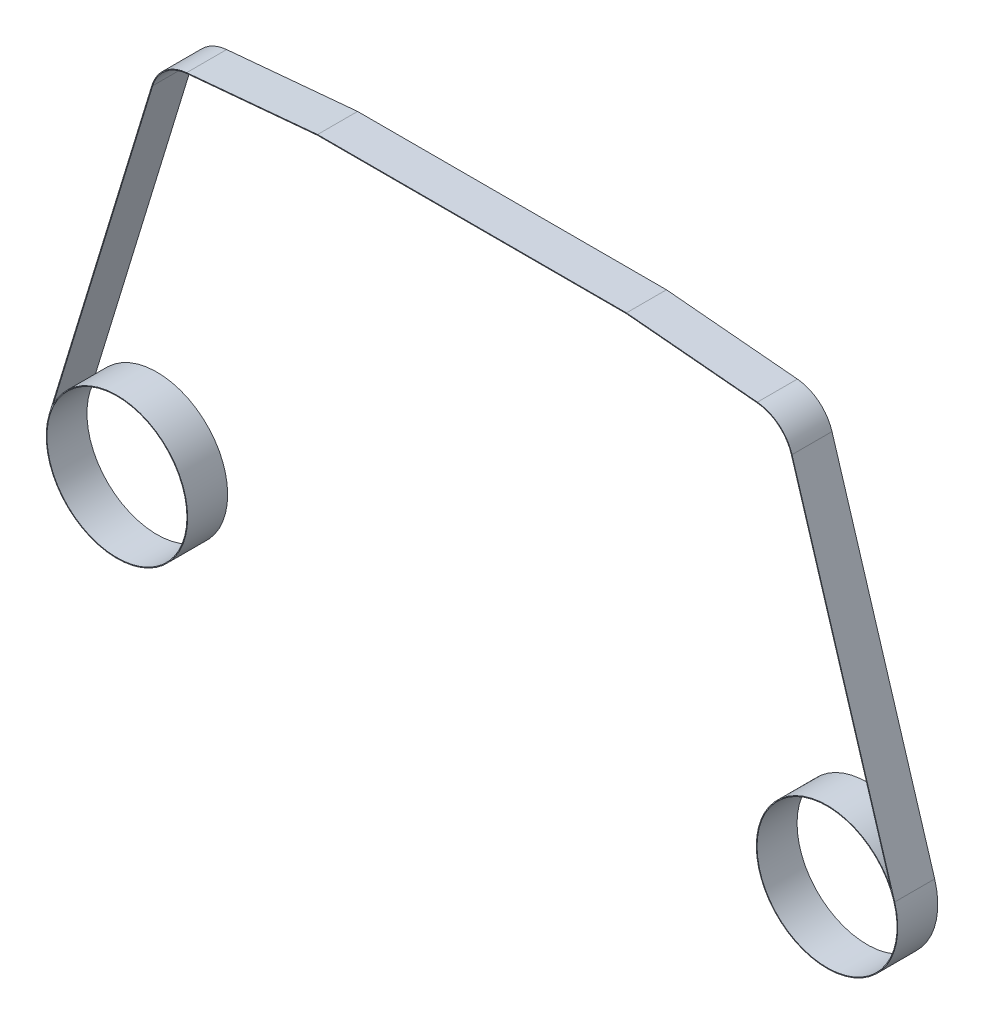
ISO-10303-21;
HEADER;
FILE_DESCRIPTION(('STEP AP214'),'2;1');
FILE_NAME('part.step','',(''),(''),'','','');
FILE_SCHEMA(('AUTOMOTIVE_DESIGN { 1 0 10303 214 1 1 1 1 }'));
ENDSEC;
DATA;
#1=APPLICATION_CONTEXT('core data for automotive mechanical design processes');
#2=APPLICATION_PROTOCOL_DEFINITION('international standard','automotive_design',2000,#1);
#3=PRODUCT_CONTEXT('',#1,'mechanical');
#4=PRODUCT('Part','Part','',(#3));
#5=PRODUCT_RELATED_PRODUCT_CATEGORY('part','',(#4));
#6=PRODUCT_DEFINITION_FORMATION('','',#4);
#7=PRODUCT_DEFINITION_CONTEXT('part definition',#1,'design');
#8=PRODUCT_DEFINITION('design','',#6,#7);
#9=PRODUCT_DEFINITION_SHAPE('','',#8);
#10=(LENGTH_UNIT() NAMED_UNIT(*) SI_UNIT(.MILLI.,.METRE.));
#11=(NAMED_UNIT(*) PLANE_ANGLE_UNIT() SI_UNIT($,.RADIAN.));
#12=(NAMED_UNIT(*) SI_UNIT($,.STERADIAN.) SOLID_ANGLE_UNIT());
#13=UNCERTAINTY_MEASURE_WITH_UNIT(LENGTH_MEASURE(1.E-05),#10,'distance_accuracy_value','');
#14=(GEOMETRIC_REPRESENTATION_CONTEXT(3) GLOBAL_UNCERTAINTY_ASSIGNED_CONTEXT((#13)) GLOBAL_UNIT_ASSIGNED_CONTEXT((#10,
#11,#12)) REPRESENTATION_CONTEXT('',''));
#15=CARTESIAN_POINT('',(0.,0.,0.));
#16=DIRECTION('',(0.,0.,1.));
#17=DIRECTION('',(1.,0.,0.));
#18=AXIS2_PLACEMENT_3D('',#15,#16,#17);
#19=CARTESIAN_POINT('',(35.5,0.,2.));
#20=DIRECTION('',(0.,0.,-1.));
#21=DIRECTION('',(-1.,0.,0.));
#22=AXIS2_PLACEMENT_3D('',#19,#20,#21);
#23=PLANE('',#22);
#24=CARTESIAN_POINT('',(-35.5,0.,2.));
#25=DIRECTION('',(0.,0.,1.));
#26=DIRECTION('',(1.,0.,0.));
#27=AXIS2_PLACEMENT_3D('',#24,#25,#26);
#28=CIRCLE('',#27,7.);
#29=CARTESIAN_POINT('',(-28.5,0.,2.));
#30=VERTEX_POINT('',#29);
#31=EDGE_CURVE('E182',#30,#30,#28,.T.);
#32=ORIENTED_EDGE('',*,*,#31,.F.);
#33=EDGE_LOOP('',(#32));
#34=FACE_BOUND('',#33,.T.);
#35=CARTESIAN_POINT('',(35.5,0.,2.));
#36=DIRECTION('',(0.,0.,1.));
#37=DIRECTION('',(-1.,0.,0.));
#38=AXIS2_PLACEMENT_3D('',#35,#36,#37);
#39=CIRCLE('',#38,7.07);
#40=CARTESIAN_POINT('',(41.9045834474519,2.9943631818177,2.));
#41=VERTEX_POINT('',#40);
#42=CARTESIAN_POINT('',(42.261492769219,2.06569976806884,2.));
#43=VERTEX_POINT('',#42);
#44=EDGE_CURVE('E209',#41,#43,#39,.T.);
#45=ORIENTED_EDGE('',*,*,#44,.T.);
#46=DIRECTION('',(-0.292178185016809,0.9563638994652,0.));
#47=VECTOR('',#46,1.);
#48=CARTESIAN_POINT('',(31.9954555978608,35.6687127400672,2.));
#49=LINE('',#48,#47);
#50=CARTESIAN_POINT('',(31.9954555978608,35.6687127400672,2.));
#51=VERTEX_POINT('',#50);
#52=EDGE_CURVE('E117',#43,#51,#49,.T.);
#53=ORIENTED_EDGE('',*,*,#52,.T.);
#54=CARTESIAN_POINT('',(28.17,34.5,2.));
#55=DIRECTION('',(0.,0.,1.));
#56=DIRECTION('',(-1.,0.,0.));
#57=AXIS2_PLACEMENT_3D('',#54,#55,#56);
#58=CIRCLE('',#57,4.);
#59=CARTESIAN_POINT('',(28.5310758735914,38.4836696918181,2.));
#60=VERTEX_POINT('',#59);
#61=EDGE_CURVE('E248',#51,#60,#58,.T.);
#62=ORIENTED_EDGE('',*,*,#61,.T.);
#63=DIRECTION('',(-0.995917422954527,0.0902689683978569,0.));
#64=VECTOR('',#63,1.);
#65=CARTESIAN_POINT('',(28.5310758735914,38.4836696918181,2.));
#66=LINE('',#65,#64);
#67=CARTESIAN_POINT('',(15.44255781177,39.67,2.));
#68=VERTEX_POINT('',#67);
#69=EDGE_CURVE('E267',#60,#68,#66,.T.);
#70=ORIENTED_EDGE('',*,*,#69,.T.);
#71=DIRECTION('',(-1.,0.,0.));
#72=VECTOR('',#71,1.);
#73=CARTESIAN_POINT('',(-15.44255781177,39.67,2.));
#74=LINE('',#73,#72);
#75=CARTESIAN_POINT('',(-15.44255781177,39.67,2.));
#76=VERTEX_POINT('',#75);
#77=EDGE_CURVE('E264',#68,#76,#74,.T.);
#78=ORIENTED_EDGE('',*,*,#77,.T.);
#79=DIRECTION('',(-0.995917422954527,-0.0902689683978569,0.));
#80=VECTOR('',#79,1.);
#81=CARTESIAN_POINT('',(-28.5310758735914,38.4836696918181,2.));
#82=LINE('',#81,#80);
#83=CARTESIAN_POINT('',(-28.5310758735914,38.4836696918181,2.));
#84=VERTEX_POINT('',#83);
#85=EDGE_CURVE('E266',#76,#84,#82,.T.);
#86=ORIENTED_EDGE('',*,*,#85,.T.);
#87=CARTESIAN_POINT('',(-28.17,34.5,2.));
#88=DIRECTION('',(0.,0.,1.));
#89=DIRECTION('',(1.,0.,0.));
#90=AXIS2_PLACEMENT_3D('',#87,#88,#89);
#91=CIRCLE('',#90,4.);
#92=CARTESIAN_POINT('',(-31.9954555978608,35.6687127400672,2.));
#93=VERTEX_POINT('',#92);
#94=EDGE_CURVE('E269',#84,#93,#91,.T.);
#95=ORIENTED_EDGE('',*,*,#94,.T.);
#96=DIRECTION('',(-0.292178185016809,-0.9563638994652,0.));
#97=VECTOR('',#96,1.);
#98=CARTESIAN_POINT('',(-31.9954555978608,35.6687127400672,2.));
#99=LINE('',#98,#97);
#100=CARTESIAN_POINT('',(-42.261492769219,2.06569976806883,2.));
#101=VERTEX_POINT('',#100);
#102=EDGE_CURVE('E275',#93,#101,#99,.T.);
#103=ORIENTED_EDGE('',*,*,#102,.T.);
#104=CARTESIAN_POINT('',(-35.5,0.,2.));
#105=DIRECTION('',(0.,0.,1.));
#106=DIRECTION('',(1.,0.,0.));
#107=AXIS2_PLACEMENT_3D('',#104,#105,#106);
#108=CIRCLE('',#107,7.07);
#109=CARTESIAN_POINT('',(-41.9045834474519,2.9943631818177,2.));
#110=VERTEX_POINT('',#109);
#111=EDGE_CURVE('E277',#101,#110,#108,.T.);
#112=ORIENTED_EDGE('',*,*,#111,.T.);
#113=DIRECTION('',(0.292178185016809,0.9563638994652,0.));
#114=VECTOR('',#113,1.);
#115=CARTESIAN_POINT('',(-31.9285101248982,35.6482602671161,2.));
#116=LINE('',#115,#114);
#117=CARTESIAN_POINT('',(-31.9285101248982,35.6482602671161,2.));
#118=VERTEX_POINT('',#117);
#119=EDGE_CURVE('E279',#110,#118,#116,.T.);
#120=ORIENTED_EDGE('',*,*,#119,.T.);
#121=CARTESIAN_POINT('',(-28.17,34.5,2.));
#122=DIRECTION('',(0.,0.,-1.));
#123=DIRECTION('',(1.,0.,0.));
#124=AXIS2_PLACEMENT_3D('',#121,#122,#123);
#125=CIRCLE('',#124,3.93);
#126=CARTESIAN_POINT('',(-28.5247570458036,38.4139554722113,2.));
#127=VERTEX_POINT('',#126);
#128=EDGE_CURVE('E281',#118,#127,#125,.T.);
#129=ORIENTED_EDGE('',*,*,#128,.T.);
#130=DIRECTION('',(0.995917422954527,0.0902689683978578,0.));
#131=VECTOR('',#130,1.);
#132=CARTESIAN_POINT('',(-28.5247570458036,38.4139554722113,2.));
#133=LINE('',#132,#131);
#134=CARTESIAN_POINT('',(-15.4393919354091,39.6,2.));
#135=VERTEX_POINT('',#134);
#136=EDGE_CURVE('E283',#127,#135,#133,.T.);
#137=ORIENTED_EDGE('',*,*,#136,.T.);
#138=DIRECTION('',(1.,0.,0.));
#139=VECTOR('',#138,1.);
#140=CARTESIAN_POINT('',(-15.4393919354091,39.6,2.));
#141=LINE('',#140,#139);
#142=CARTESIAN_POINT('',(15.4393919354091,39.6,2.));
#143=VERTEX_POINT('',#142);
#144=EDGE_CURVE('E160',#135,#143,#141,.T.);
#145=ORIENTED_EDGE('',*,*,#144,.T.);
#146=DIRECTION('',(0.995917422954527,-0.0902689683978578,0.));
#147=VECTOR('',#146,1.);
#148=CARTESIAN_POINT('',(28.5247570458036,38.4139554722113,2.));
#149=LINE('',#148,#147);
#150=CARTESIAN_POINT('',(28.5247570458036,38.4139554722113,2.));
#151=VERTEX_POINT('',#150);
#152=EDGE_CURVE('E154',#143,#151,#149,.T.);
#153=ORIENTED_EDGE('',*,*,#152,.T.);
#154=CARTESIAN_POINT('',(28.17,34.5,2.));
#155=DIRECTION('',(0.,0.,-1.));
#156=DIRECTION('',(-1.,0.,0.));
#157=AXIS2_PLACEMENT_3D('',#154,#155,#156);
#158=CIRCLE('',#157,3.93);
#159=CARTESIAN_POINT('',(31.9285101248982,35.6482602671161,2.));
#160=VERTEX_POINT('',#159);
#161=EDGE_CURVE('E158',#151,#160,#158,.T.);
#162=ORIENTED_EDGE('',*,*,#161,.T.);
#163=DIRECTION('',(0.292178185016809,-0.9563638994652,0.));
#164=VECTOR('',#163,1.);
#165=CARTESIAN_POINT('',(31.9285101248982,35.6482602671161,2.));
#166=LINE('',#165,#164);
#167=EDGE_CURVE('E50',#160,#41,#166,.T.);
#168=ORIENTED_EDGE('',*,*,#167,.T.);
#169=EDGE_LOOP('',(#45,#53,#62,#70,#78,#86,#95,#103,#112,#120,#129,#137,#145,#153,#162,#168));
#170=FACE_BOUND('',#169,.T.);
#171=CARTESIAN_POINT('',(35.5,0.,2.));
#172=DIRECTION('',(0.,0.,1.));
#173=DIRECTION('',(-1.,0.,0.));
#174=AXIS2_PLACEMENT_3D('',#171,#172,#173);
#175=CIRCLE('',#174,7.);
#176=CARTESIAN_POINT('',(28.5,0.,2.));
#177=VERTEX_POINT('',#176);
#178=EDGE_CURVE('E326',#177,#177,#175,.T.);
#179=ORIENTED_EDGE('',*,*,#178,.F.);
#180=EDGE_LOOP('',(#179));
#181=FACE_BOUND('',#180,.T.);
#182=ADVANCED_FACE('F33',(#34,#170,#181),#23,.F.);
#183=CARTESIAN_POINT('',(35.5,0.,-2.));
#184=DIRECTION('',(0.,0.,-1.));
#185=DIRECTION('',(-1.,0.,0.));
#186=AXIS2_PLACEMENT_3D('',#183,#184,#185);
#187=PLANE('',#186);
#188=CARTESIAN_POINT('',(-35.5,0.,-2.));
#189=DIRECTION('',(0.,0.,1.));
#190=DIRECTION('',(1.,0.,0.));
#191=AXIS2_PLACEMENT_3D('',#188,#189,#190);
#192=CIRCLE('',#191,7.);
#193=CARTESIAN_POINT('',(-28.5,0.,-2.));
#194=VERTEX_POINT('',#193);
#195=EDGE_CURVE('E331',#194,#194,#192,.T.);
#196=ORIENTED_EDGE('',*,*,#195,.T.);
#197=EDGE_LOOP('',(#196));
#198=FACE_BOUND('',#197,.T.);
#199=CARTESIAN_POINT('',(35.5,0.,-2.));
#200=DIRECTION('',(0.,0.,1.));
#201=DIRECTION('',(-1.,0.,0.));
#202=AXIS2_PLACEMENT_3D('',#199,#200,#201);
#203=CIRCLE('',#202,7.07);
#204=CARTESIAN_POINT('',(41.9045834474519,2.9943631818177,-2.));
#205=VERTEX_POINT('',#204);
#206=CARTESIAN_POINT('',(42.261492769219,2.06569976806884,-2.));
#207=VERTEX_POINT('',#206);
#208=EDGE_CURVE('E178',#205,#207,#203,.T.);
#209=ORIENTED_EDGE('',*,*,#208,.F.);
#210=DIRECTION('',(0.292178185016809,-0.9563638994652,0.));
#211=VECTOR('',#210,1.);
#212=CARTESIAN_POINT('',(31.9285101248982,35.6482602671161,-2.));
#213=LINE('',#212,#211);
#214=CARTESIAN_POINT('',(31.9285101248982,35.6482602671161,-2.));
#215=VERTEX_POINT('',#214);
#216=EDGE_CURVE('E109',#215,#205,#213,.T.);
#217=ORIENTED_EDGE('',*,*,#216,.F.);
#218=CARTESIAN_POINT('',(28.17,34.5,-2.));
#219=DIRECTION('',(0.,0.,-1.));
#220=DIRECTION('',(-1.,0.,0.));
#221=AXIS2_PLACEMENT_3D('',#218,#219,#220);
#222=CIRCLE('',#221,3.93);
#223=CARTESIAN_POINT('',(28.5247570458036,38.4139554722113,-2.));
#224=VERTEX_POINT('',#223);
#225=EDGE_CURVE('E103',#224,#215,#222,.T.);
#226=ORIENTED_EDGE('',*,*,#225,.F.);
#227=DIRECTION('',(0.995917422954527,-0.0902689683978578,0.));
#228=VECTOR('',#227,1.);
#229=CARTESIAN_POINT('',(28.5247570458036,38.4139554722113,-2.));
#230=LINE('',#229,#228);
#231=CARTESIAN_POINT('',(15.4393919354091,39.6,-2.));
#232=VERTEX_POINT('',#231);
#233=EDGE_CURVE('E168',#232,#224,#230,.T.);
#234=ORIENTED_EDGE('',*,*,#233,.F.);
#235=DIRECTION('',(1.,0.,0.));
#236=VECTOR('',#235,1.);
#237=CARTESIAN_POINT('',(-15.4393919354091,39.6,-2.));
#238=LINE('',#237,#236);
#239=CARTESIAN_POINT('',(-15.4393919354091,39.6,-2.));
#240=VERTEX_POINT('',#239);
#241=EDGE_CURVE('E204',#240,#232,#238,.T.);
#242=ORIENTED_EDGE('',*,*,#241,.F.);
#243=DIRECTION('',(0.995917422954527,0.0902689683978578,0.));
#244=VECTOR('',#243,1.);
#245=CARTESIAN_POINT('',(-28.5247570458036,38.4139554722113,-2.));
#246=LINE('',#245,#244);
#247=CARTESIAN_POINT('',(-28.5247570458036,38.4139554722113,-2.));
#248=VERTEX_POINT('',#247);
#249=EDGE_CURVE('E202',#248,#240,#246,.T.);
#250=ORIENTED_EDGE('',*,*,#249,.F.);
#251=CARTESIAN_POINT('',(-28.17,34.5,-2.));
#252=DIRECTION('',(0.,0.,-1.));
#253=DIRECTION('',(1.,0.,0.));
#254=AXIS2_PLACEMENT_3D('',#251,#252,#253);
#255=CIRCLE('',#254,3.93);
#256=CARTESIAN_POINT('',(-31.9285101248982,35.6482602671161,-2.));
#257=VERTEX_POINT('',#256);
#258=EDGE_CURVE('E200',#257,#248,#255,.T.);
#259=ORIENTED_EDGE('',*,*,#258,.F.);
#260=DIRECTION('',(0.292178185016809,0.9563638994652,0.));
#261=VECTOR('',#260,1.);
#262=CARTESIAN_POINT('',(-31.9285101248982,35.6482602671161,-2.));
#263=LINE('',#262,#261);
#264=CARTESIAN_POINT('',(-41.9045834474519,2.9943631818177,-2.));
#265=VERTEX_POINT('',#264);
#266=EDGE_CURVE('E198',#265,#257,#263,.T.);
#267=ORIENTED_EDGE('',*,*,#266,.F.);
#268=CARTESIAN_POINT('',(-35.5,0.,-2.));
#269=DIRECTION('',(0.,0.,1.));
#270=DIRECTION('',(1.,0.,0.));
#271=AXIS2_PLACEMENT_3D('',#268,#269,#270);
#272=CIRCLE('',#271,7.07);
#273=CARTESIAN_POINT('',(-42.261492769219,2.06569976806883,-2.));
#274=VERTEX_POINT('',#273);
#275=EDGE_CURVE('E196',#274,#265,#272,.T.);
#276=ORIENTED_EDGE('',*,*,#275,.F.);
#277=DIRECTION('',(-0.292178185016809,-0.9563638994652,0.));
#278=VECTOR('',#277,1.);
#279=CARTESIAN_POINT('',(-31.9954555978608,35.6687127400672,-2.));
#280=LINE('',#279,#278);
#281=CARTESIAN_POINT('',(-31.9954555978608,35.6687127400672,-2.));
#282=VERTEX_POINT('',#281);
#283=EDGE_CURVE('E194',#282,#274,#280,.T.);
#284=ORIENTED_EDGE('',*,*,#283,.F.);
#285=CARTESIAN_POINT('',(-28.17,34.5,-2.));
#286=DIRECTION('',(0.,0.,1.));
#287=DIRECTION('',(1.,0.,0.));
#288=AXIS2_PLACEMENT_3D('',#285,#286,#287);
#289=CIRCLE('',#288,4.);
#290=CARTESIAN_POINT('',(-28.5310758735914,38.4836696918181,-2.));
#291=VERTEX_POINT('',#290);
#292=EDGE_CURVE('E192',#291,#282,#289,.T.);
#293=ORIENTED_EDGE('',*,*,#292,.F.);
#294=DIRECTION('',(-0.995917422954527,-0.0902689683978569,0.));
#295=VECTOR('',#294,1.);
#296=CARTESIAN_POINT('',(-28.5310758735914,38.4836696918181,-2.));
#297=LINE('',#296,#295);
#298=CARTESIAN_POINT('',(-15.44255781177,39.67,-2.));
#299=VERTEX_POINT('',#298);
#300=EDGE_CURVE('E190',#299,#291,#297,.T.);
#301=ORIENTED_EDGE('',*,*,#300,.F.);
#302=DIRECTION('',(-1.,0.,0.));
#303=VECTOR('',#302,1.);
#304=CARTESIAN_POINT('',(-15.44255781177,39.67,-2.));
#305=LINE('',#304,#303);
#306=CARTESIAN_POINT('',(15.44255781177,39.67,-2.));
#307=VERTEX_POINT('',#306);
#308=EDGE_CURVE('E188',#307,#299,#305,.T.);
#309=ORIENTED_EDGE('',*,*,#308,.F.);
#310=DIRECTION('',(-0.995917422954527,0.0902689683978569,0.));
#311=VECTOR('',#310,1.);
#312=CARTESIAN_POINT('',(28.5310758735914,38.4836696918181,-2.));
#313=LINE('',#312,#311);
#314=CARTESIAN_POINT('',(28.5310758735914,38.4836696918181,-2.));
#315=VERTEX_POINT('',#314);
#316=EDGE_CURVE('E186',#315,#307,#313,.T.);
#317=ORIENTED_EDGE('',*,*,#316,.F.);
#318=CARTESIAN_POINT('',(28.17,34.5,-2.));
#319=DIRECTION('',(0.,0.,1.));
#320=DIRECTION('',(-1.,0.,0.));
#321=AXIS2_PLACEMENT_3D('',#318,#319,#320);
#322=CIRCLE('',#321,4.);
#323=CARTESIAN_POINT('',(31.9954555978608,35.6687127400672,-2.));
#324=VERTEX_POINT('',#323);
#325=EDGE_CURVE('E184',#324,#315,#322,.T.);
#326=ORIENTED_EDGE('',*,*,#325,.F.);
#327=DIRECTION('',(-0.292178185016809,0.9563638994652,0.));
#328=VECTOR('',#327,1.);
#329=CARTESIAN_POINT('',(31.9954555978608,35.6687127400672,-2.));
#330=LINE('',#329,#328);
#331=EDGE_CURVE('E181',#207,#324,#330,.T.);
#332=ORIENTED_EDGE('',*,*,#331,.F.);
#333=EDGE_LOOP('',(#209,#217,#226,#234,#242,#250,#259,#267,#276,#284,#293,#301,#309,#317,#326,#332));
#334=FACE_BOUND('',#333,.T.);
#335=CARTESIAN_POINT('',(35.5,0.,-2.));
#336=DIRECTION('',(0.,0.,1.));
#337=DIRECTION('',(-1.,0.,0.));
#338=AXIS2_PLACEMENT_3D('',#335,#336,#337);
#339=CIRCLE('',#338,7.);
#340=CARTESIAN_POINT('',(28.5,0.,-2.));
#341=VERTEX_POINT('',#340);
#342=EDGE_CURVE('E329',#341,#341,#339,.T.);
#343=ORIENTED_EDGE('',*,*,#342,.T.);
#344=EDGE_LOOP('',(#343));
#345=FACE_BOUND('',#344,.T.);
#346=ADVANCED_FACE('F252',(#198,#334,#345),#187,.T.);
#347=CARTESIAN_POINT('',(35.5,0.,2.));
#348=DIRECTION('',(0.,0.,-1.));
#349=DIRECTION('',(-1.,0.,0.));
#350=AXIS2_PLACEMENT_3D('',#347,#348,#349);
#351=CYLINDRICAL_SURFACE('',#350,7.07);
#352=ORIENTED_EDGE('',*,*,#208,.T.);
#353=DIRECTION('',(0.,0.,-1.));
#354=VECTOR('',#353,1.);
#355=CARTESIAN_POINT('',(42.261492769219,2.06569976806884,2.));
#356=LINE('',#355,#354);
#357=EDGE_CURVE('E11',#43,#207,#356,.T.);
#358=ORIENTED_EDGE('',*,*,#357,.F.);
#359=ORIENTED_EDGE('',*,*,#44,.F.);
#360=DIRECTION('',(0.,0.,-1.));
#361=VECTOR('',#360,1.);
#362=CARTESIAN_POINT('',(41.9045834474519,2.9943631818177,2.));
#363=LINE('',#362,#361);
#364=EDGE_CURVE('E174',#41,#205,#363,.T.);
#365=ORIENTED_EDGE('',*,*,#364,.T.);
#366=EDGE_LOOP('',(#352,#358,#359,#365));
#367=FACE_BOUND('',#366,.T.);
#368=ADVANCED_FACE('F35',(#367),#351,.T.);
#369=CARTESIAN_POINT('',(31.9954555978608,35.6687127400672,2.));
#370=DIRECTION('',(-0.9563638994652,-0.292178185016809,0.));
#371=DIRECTION('',(0.292178185016809,-0.9563638994652,0.));
#372=AXIS2_PLACEMENT_3D('',#369,#370,#371);
#373=PLANE('',#372);
#374=ORIENTED_EDGE('',*,*,#331,.T.);
#375=DIRECTION('',(0.,0.,-1.));
#376=VECTOR('',#375,1.);
#377=CARTESIAN_POINT('',(31.9954555978608,35.6687127400672,2.));
#378=LINE('',#377,#376);
#379=EDGE_CURVE('E42',#51,#324,#378,.T.);
#380=ORIENTED_EDGE('',*,*,#379,.F.);
#381=ORIENTED_EDGE('',*,*,#52,.F.);
#382=ORIENTED_EDGE('',*,*,#357,.T.);
#383=EDGE_LOOP('',(#374,#380,#381,#382));
#384=FACE_BOUND('',#383,.T.);
#385=ADVANCED_FACE('F464',(#384),#373,.F.);
#386=CARTESIAN_POINT('',(28.17,34.5,2.));
#387=DIRECTION('',(0.,0.,-1.));
#388=DIRECTION('',(-1.,0.,0.));
#389=AXIS2_PLACEMENT_3D('',#386,#387,#388);
#390=CYLINDRICAL_SURFACE('',#389,4.);
#391=ORIENTED_EDGE('',*,*,#325,.T.);
#392=DIRECTION('',(0.,0.,-1.));
#393=VECTOR('',#392,1.);
#394=CARTESIAN_POINT('',(28.5310758735914,38.4836696918181,2.));
#395=LINE('',#394,#393);
#396=EDGE_CURVE('E240',#60,#315,#395,.T.);
#397=ORIENTED_EDGE('',*,*,#396,.F.);
#398=ORIENTED_EDGE('',*,*,#61,.F.);
#399=ORIENTED_EDGE('',*,*,#379,.T.);
#400=EDGE_LOOP('',(#391,#397,#398,#399));
#401=FACE_BOUND('',#400,.T.);
#402=ADVANCED_FACE('F246',(#401),#390,.T.);
#403=CARTESIAN_POINT('',(28.5310758735914,38.4836696918181,2.));
#404=DIRECTION('',(-0.0902689683978569,-0.995917422954527,0.));
#405=DIRECTION('',(0.995917422954527,-0.0902689683978569,0.));
#406=AXIS2_PLACEMENT_3D('',#403,#404,#405);
#407=PLANE('',#406);
#408=ORIENTED_EDGE('',*,*,#316,.T.);
#409=DIRECTION('',(0.,0.,-1.));
#410=VECTOR('',#409,1.);
#411=CARTESIAN_POINT('',(15.44255781177,39.67,2.));
#412=LINE('',#411,#410);
#413=EDGE_CURVE('E237',#68,#307,#412,.T.);
#414=ORIENTED_EDGE('',*,*,#413,.F.);
#415=ORIENTED_EDGE('',*,*,#69,.F.);
#416=ORIENTED_EDGE('',*,*,#396,.T.);
#417=EDGE_LOOP('',(#408,#414,#415,#416));
#418=FACE_BOUND('',#417,.T.);
#419=ADVANCED_FACE('F258',(#418),#407,.F.);
#420=CARTESIAN_POINT('',(-15.44255781177,39.67,2.));
#421=DIRECTION('',(0.,-1.,0.));
#422=DIRECTION('',(0.,0.,-1.));
#423=AXIS2_PLACEMENT_3D('',#420,#421,#422);
#424=PLANE('',#423);
#425=ORIENTED_EDGE('',*,*,#308,.T.);
#426=DIRECTION('',(0.,0.,-1.));
#427=VECTOR('',#426,1.);
#428=CARTESIAN_POINT('',(-15.44255781177,39.67,2.));
#429=LINE('',#428,#427);
#430=EDGE_CURVE('E234',#76,#299,#429,.T.);
#431=ORIENTED_EDGE('',*,*,#430,.F.);
#432=ORIENTED_EDGE('',*,*,#77,.F.);
#433=ORIENTED_EDGE('',*,*,#413,.T.);
#434=EDGE_LOOP('',(#425,#431,#432,#433));
#435=FACE_BOUND('',#434,.T.);
#436=ADVANCED_FACE('F262',(#435),#424,.F.);
#437=CARTESIAN_POINT('',(-28.5310758735914,38.4836696918181,2.));
#438=DIRECTION('',(0.0902689683978569,-0.995917422954527,0.));
#439=DIRECTION('',(0.995917422954527,0.0902689683978569,0.));
#440=AXIS2_PLACEMENT_3D('',#437,#438,#439);
#441=PLANE('',#440);
#442=ORIENTED_EDGE('',*,*,#300,.T.);
#443=DIRECTION('',(0.,0.,-1.));
#444=VECTOR('',#443,1.);
#445=CARTESIAN_POINT('',(-28.5310758735914,38.4836696918181,2.));
#446=LINE('',#445,#444);
#447=EDGE_CURVE('E231',#84,#291,#446,.T.);
#448=ORIENTED_EDGE('',*,*,#447,.F.);
#449=ORIENTED_EDGE('',*,*,#85,.F.);
#450=ORIENTED_EDGE('',*,*,#430,.T.);
#451=EDGE_LOOP('',(#442,#448,#449,#450));
#452=FACE_BOUND('',#451,.T.);
#453=ADVANCED_FACE('F429',(#452),#441,.F.);
#454=CARTESIAN_POINT('',(-28.17,34.5,2.));
#455=DIRECTION('',(0.,0.,-1.));
#456=DIRECTION('',(-1.,0.,0.));
#457=AXIS2_PLACEMENT_3D('',#454,#455,#456);
#458=CYLINDRICAL_SURFACE('',#457,4.);
#459=ORIENTED_EDGE('',*,*,#292,.T.);
#460=DIRECTION('',(0.,0.,-1.));
#461=VECTOR('',#460,1.);
#462=CARTESIAN_POINT('',(-31.9954555978608,35.6687127400672,2.));
#463=LINE('',#462,#461);
#464=EDGE_CURVE('E228',#93,#282,#463,.T.);
#465=ORIENTED_EDGE('',*,*,#464,.F.);
#466=ORIENTED_EDGE('',*,*,#94,.F.);
#467=ORIENTED_EDGE('',*,*,#447,.T.);
#468=EDGE_LOOP('',(#459,#465,#466,#467));
#469=FACE_BOUND('',#468,.T.);
#470=ADVANCED_FACE('F419',(#469),#458,.T.);
#471=CARTESIAN_POINT('',(-31.9954555978608,35.6687127400672,2.));
#472=DIRECTION('',(0.9563638994652,-0.292178185016809,0.));
#473=DIRECTION('',(0.292178185016809,0.9563638994652,0.));
#474=AXIS2_PLACEMENT_3D('',#471,#472,#473);
#475=PLANE('',#474);
#476=ORIENTED_EDGE('',*,*,#283,.T.);
#477=DIRECTION('',(0.,0.,-1.));
#478=VECTOR('',#477,1.);
#479=CARTESIAN_POINT('',(-42.261492769219,2.06569976806883,2.));
#480=LINE('',#479,#478);
#481=EDGE_CURVE('E225',#101,#274,#480,.T.);
#482=ORIENTED_EDGE('',*,*,#481,.F.);
#483=ORIENTED_EDGE('',*,*,#102,.F.);
#484=ORIENTED_EDGE('',*,*,#464,.T.);
#485=EDGE_LOOP('',(#476,#482,#483,#484));
#486=FACE_BOUND('',#485,.T.);
#487=ADVANCED_FACE('F409',(#486),#475,.F.);
#488=CARTESIAN_POINT('',(-35.5,0.,2.));
#489=DIRECTION('',(0.,0.,-1.));
#490=DIRECTION('',(-1.,0.,0.));
#491=AXIS2_PLACEMENT_3D('',#488,#489,#490);
#492=CYLINDRICAL_SURFACE('',#491,7.07);
#493=ORIENTED_EDGE('',*,*,#275,.T.);
#494=DIRECTION('',(0.,0.,-1.));
#495=VECTOR('',#494,1.);
#496=CARTESIAN_POINT('',(-41.9045834474519,2.9943631818177,2.));
#497=LINE('',#496,#495);
#498=EDGE_CURVE('E222',#110,#265,#497,.T.);
#499=ORIENTED_EDGE('',*,*,#498,.F.);
#500=ORIENTED_EDGE('',*,*,#111,.F.);
#501=ORIENTED_EDGE('',*,*,#481,.T.);
#502=EDGE_LOOP('',(#493,#499,#500,#501));
#503=FACE_BOUND('',#502,.T.);
#504=ADVANCED_FACE('F399',(#503),#492,.T.);
#505=CARTESIAN_POINT('',(-31.9285101248982,35.6482602671161,2.));
#506=DIRECTION('',(-0.9563638994652,0.292178185016809,0.));
#507=DIRECTION('',(-0.292178185016809,-0.9563638994652,0.));
#508=AXIS2_PLACEMENT_3D('',#505,#506,#507);
#509=PLANE('',#508);
#510=ORIENTED_EDGE('',*,*,#266,.T.);
#511=DIRECTION('',(0.,0.,-1.));
#512=VECTOR('',#511,1.);
#513=CARTESIAN_POINT('',(-31.9285101248982,35.6482602671161,2.));
#514=LINE('',#513,#512);
#515=EDGE_CURVE('E219',#118,#257,#514,.T.);
#516=ORIENTED_EDGE('',*,*,#515,.F.);
#517=ORIENTED_EDGE('',*,*,#119,.F.);
#518=ORIENTED_EDGE('',*,*,#498,.T.);
#519=EDGE_LOOP('',(#510,#516,#517,#518));
#520=FACE_BOUND('',#519,.T.);
#521=ADVANCED_FACE('F389',(#520),#509,.F.);
#522=CARTESIAN_POINT('',(-28.17,34.5,2.));
#523=DIRECTION('',(0.,0.,-1.));
#524=DIRECTION('',(-1.,0.,0.));
#525=AXIS2_PLACEMENT_3D('',#522,#523,#524);
#526=CYLINDRICAL_SURFACE('',#525,3.93);
#527=ORIENTED_EDGE('',*,*,#258,.T.);
#528=DIRECTION('',(0.,0.,-1.));
#529=VECTOR('',#528,1.);
#530=CARTESIAN_POINT('',(-28.5247570458036,38.4139554722113,2.));
#531=LINE('',#530,#529);
#532=EDGE_CURVE('E216',#127,#248,#531,.T.);
#533=ORIENTED_EDGE('',*,*,#532,.F.);
#534=ORIENTED_EDGE('',*,*,#128,.F.);
#535=ORIENTED_EDGE('',*,*,#515,.T.);
#536=EDGE_LOOP('',(#527,#533,#534,#535));
#537=FACE_BOUND('',#536,.T.);
#538=ADVANCED_FACE('F380',(#537),#526,.F.);
#539=CARTESIAN_POINT('',(-28.5247570458036,38.4139554722113,2.));
#540=DIRECTION('',(-0.0902689683978578,0.995917422954527,0.));
#541=DIRECTION('',(-0.995917422954527,-0.0902689683978579,0.));
#542=AXIS2_PLACEMENT_3D('',#539,#540,#541);
#543=PLANE('',#542);
#544=ORIENTED_EDGE('',*,*,#249,.T.);
#545=DIRECTION('',(0.,0.,-1.));
#546=VECTOR('',#545,1.);
#547=CARTESIAN_POINT('',(-15.4393919354091,39.6,2.));
#548=LINE('',#547,#546);
#549=EDGE_CURVE('E213',#135,#240,#548,.T.);
#550=ORIENTED_EDGE('',*,*,#549,.F.);
#551=ORIENTED_EDGE('',*,*,#136,.F.);
#552=ORIENTED_EDGE('',*,*,#532,.T.);
#553=EDGE_LOOP('',(#544,#550,#551,#552));
#554=FACE_BOUND('',#553,.T.);
#555=ADVANCED_FACE('F289',(#554),#543,.F.);
#556=CARTESIAN_POINT('',(-15.4393919354091,39.6,2.));
#557=DIRECTION('',(0.,1.,0.));
#558=DIRECTION('',(0.,0.,1.));
#559=AXIS2_PLACEMENT_3D('',#556,#557,#558);
#560=PLANE('',#559);
#561=ORIENTED_EDGE('',*,*,#241,.T.);
#562=DIRECTION('',(0.,0.,-1.));
#563=VECTOR('',#562,1.);
#564=CARTESIAN_POINT('',(15.4393919354091,39.6,2.));
#565=LINE('',#564,#563);
#566=EDGE_CURVE('E169',#143,#232,#565,.T.);
#567=ORIENTED_EDGE('',*,*,#566,.F.);
#568=ORIENTED_EDGE('',*,*,#144,.F.);
#569=ORIENTED_EDGE('',*,*,#549,.T.);
#570=EDGE_LOOP('',(#561,#567,#568,#569));
#571=FACE_BOUND('',#570,.T.);
#572=ADVANCED_FACE('F293',(#571),#560,.F.);
#573=CARTESIAN_POINT('',(28.5247570458036,38.4139554722113,2.));
#574=DIRECTION('',(0.0902689683978578,0.995917422954527,0.));
#575=DIRECTION('',(-0.995917422954527,0.0902689683978579,0.));
#576=AXIS2_PLACEMENT_3D('',#573,#574,#575);
#577=PLANE('',#576);
#578=ORIENTED_EDGE('',*,*,#233,.T.);
#579=DIRECTION('',(0.,0.,-1.));
#580=VECTOR('',#579,1.);
#581=CARTESIAN_POINT('',(28.5247570458036,38.4139554722113,2.));
#582=LINE('',#581,#580);
#583=EDGE_CURVE('E165',#151,#224,#582,.T.);
#584=ORIENTED_EDGE('',*,*,#583,.F.);
#585=ORIENTED_EDGE('',*,*,#152,.F.);
#586=ORIENTED_EDGE('',*,*,#566,.T.);
#587=EDGE_LOOP('',(#578,#584,#585,#586));
#588=FACE_BOUND('',#587,.T.);
#589=ADVANCED_FACE('F166',(#588),#577,.F.);
#590=CARTESIAN_POINT('',(28.17,34.5,2.));
#591=DIRECTION('',(0.,0.,-1.));
#592=DIRECTION('',(-1.,0.,0.));
#593=AXIS2_PLACEMENT_3D('',#590,#591,#592);
#594=CYLINDRICAL_SURFACE('',#593,3.93);
#595=ORIENTED_EDGE('',*,*,#225,.T.);
#596=DIRECTION('',(0.,0.,-1.));
#597=VECTOR('',#596,1.);
#598=CARTESIAN_POINT('',(31.9285101248982,35.6482602671161,2.));
#599=LINE('',#598,#597);
#600=EDGE_CURVE('E170',#160,#215,#599,.T.);
#601=ORIENTED_EDGE('',*,*,#600,.F.);
#602=ORIENTED_EDGE('',*,*,#161,.F.);
#603=ORIENTED_EDGE('',*,*,#583,.T.);
#604=EDGE_LOOP('',(#595,#601,#602,#603));
#605=FACE_BOUND('',#604,.T.);
#606=ADVANCED_FACE('F172',(#605),#594,.F.);
#607=CARTESIAN_POINT('',(31.9285101248982,35.6482602671161,2.));
#608=DIRECTION('',(0.9563638994652,0.292178185016809,0.));
#609=DIRECTION('',(-0.292178185016809,0.9563638994652,0.));
#610=AXIS2_PLACEMENT_3D('',#607,#608,#609);
#611=PLANE('',#610);
#612=ORIENTED_EDGE('',*,*,#216,.T.);
#613=ORIENTED_EDGE('',*,*,#364,.F.);
#614=ORIENTED_EDGE('',*,*,#167,.F.);
#615=ORIENTED_EDGE('',*,*,#600,.T.);
#616=EDGE_LOOP('',(#612,#613,#614,#615));
#617=FACE_BOUND('',#616,.T.);
#618=ADVANCED_FACE('F297',(#617),#611,.F.);
#619=CARTESIAN_POINT('',(-35.5,0.,2.));
#620=DIRECTION('',(0.,0.,-1.));
#621=DIRECTION('',(-1.,0.,0.));
#622=AXIS2_PLACEMENT_3D('',#619,#620,#621);
#623=CYLINDRICAL_SURFACE('',#622,7.);
#624=ORIENTED_EDGE('',*,*,#31,.T.);
#625=EDGE_LOOP('',(#624));
#626=FACE_BOUND('',#625,.T.);
#627=ORIENTED_EDGE('',*,*,#195,.F.);
#628=EDGE_LOOP('',(#627));
#629=FACE_BOUND('',#628,.T.);
#630=ADVANCED_FACE('F299',(#626,#629),#623,.F.);
#631=CARTESIAN_POINT('',(35.5,0.,2.));
#632=DIRECTION('',(0.,0.,-1.));
#633=DIRECTION('',(-1.,0.,0.));
#634=AXIS2_PLACEMENT_3D('',#631,#632,#633);
#635=CYLINDRICAL_SURFACE('',#634,7.);
#636=ORIENTED_EDGE('',*,*,#178,.T.);
#637=EDGE_LOOP('',(#636));
#638=FACE_BOUND('',#637,.T.);
#639=ORIENTED_EDGE('',*,*,#342,.F.);
#640=EDGE_LOOP('',(#639));
#641=FACE_BOUND('',#640,.T.);
#642=ADVANCED_FACE('F305',(#638,#641),#635,.F.);
#643=CLOSED_SHELL('',(#182,#346,#368,#385,#402,#419,#436,#453,#470,#487,#504,#521,#538,#555,
#572,#589,#606,#618,#630,#642));
#644=MANIFOLD_SOLID_BREP('B2',#643);
#645=ADVANCED_BREP_SHAPE_REPRESENTATION('',(#18,#644),#14);
#646=SHAPE_DEFINITION_REPRESENTATION(#9,#645);
ENDSEC;
END-ISO-10303-21;
